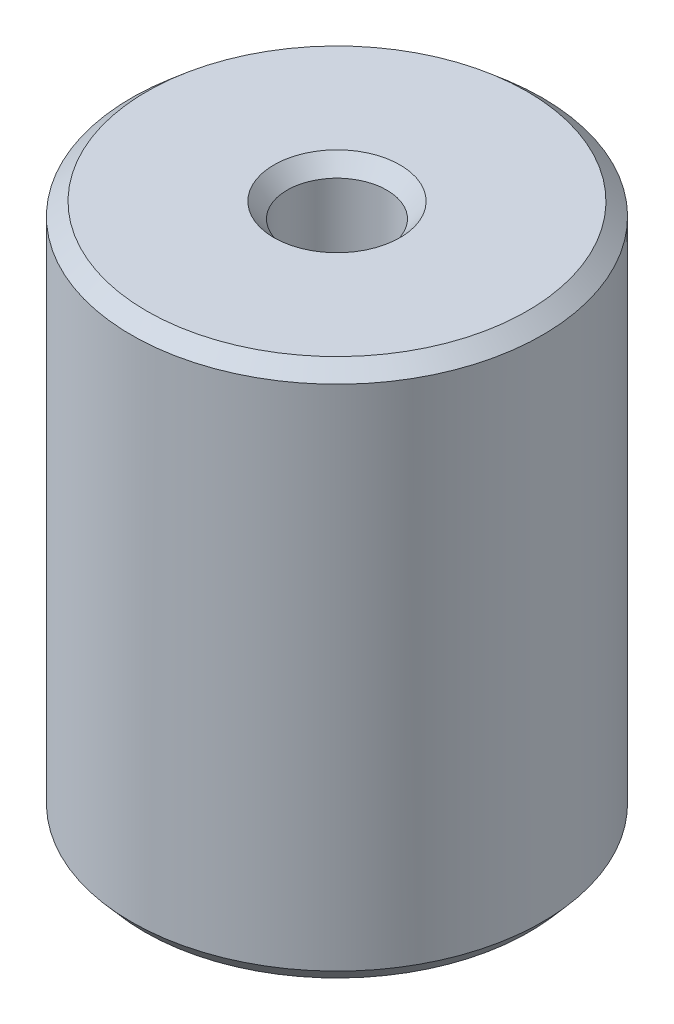
ISO-10303-21;
HEADER;
FILE_DESCRIPTION(('STEP AP214'),'2;1');
FILE_NAME('part.step','',(''),(''),'','','');
FILE_SCHEMA(('AUTOMOTIVE_DESIGN { 1 0 10303 214 1 1 1 1 }'));
ENDSEC;
DATA;
#1=APPLICATION_CONTEXT('core data for automotive mechanical design processes');
#2=APPLICATION_PROTOCOL_DEFINITION('international standard','automotive_design',2000,#1);
#3=PRODUCT_CONTEXT('',#1,'mechanical');
#4=PRODUCT('Part','Part','',(#3));
#5=PRODUCT_RELATED_PRODUCT_CATEGORY('part','',(#4));
#6=PRODUCT_DEFINITION_FORMATION('','',#4);
#7=PRODUCT_DEFINITION_CONTEXT('part definition',#1,'design');
#8=PRODUCT_DEFINITION('design','',#6,#7);
#9=PRODUCT_DEFINITION_SHAPE('','',#8);
#10=(LENGTH_UNIT() NAMED_UNIT(*) SI_UNIT(.MILLI.,.METRE.));
#11=(NAMED_UNIT(*) PLANE_ANGLE_UNIT() SI_UNIT($,.RADIAN.));
#12=(NAMED_UNIT(*) SI_UNIT($,.STERADIAN.) SOLID_ANGLE_UNIT());
#13=UNCERTAINTY_MEASURE_WITH_UNIT(LENGTH_MEASURE(1.E-05),#10,'distance_accuracy_value','');
#14=(GEOMETRIC_REPRESENTATION_CONTEXT(3) GLOBAL_UNCERTAINTY_ASSIGNED_CONTEXT((#13)) GLOBAL_UNIT_ASSIGNED_CONTEXT((#10,
#11,#12)) REPRESENTATION_CONTEXT('',''));
#15=CARTESIAN_POINT('',(0.,0.,0.));
#16=DIRECTION('',(0.,0.,1.));
#17=DIRECTION('',(1.,0.,0.));
#18=AXIS2_PLACEMENT_3D('',#15,#16,#17);
#19=CARTESIAN_POINT('',(0.,13.059607712021,0.));
#20=DIRECTION('',(0.,-1.,0.));
#21=DIRECTION('',(0.,0.,-1.));
#22=AXIS2_PLACEMENT_3D('',#19,#20,#21);
#23=CYLINDRICAL_SURFACE('',#22,5.);
#24=CARTESIAN_POINT('',(0.,0.371428901413239,0.));
#25=DIRECTION('',(0.,1.,0.));
#26=DIRECTION('',(0.,0.,1.));
#27=AXIS2_PLACEMENT_3D('',#24,#25,#26);
#28=CIRCLE('',#27,5.);
#29=CARTESIAN_POINT('',(0.,0.371428901413237,-5.));
#30=VERTEX_POINT('',#29);
#31=EDGE_CURVE('E10',#30,#30,#28,.T.);
#32=CARTESIAN_POINT('',(0.,12.7392117758964,0.));
#33=DIRECTION('',(0.,1.,0.));
#34=DIRECTION('',(0.,0.,1.));
#35=AXIS2_PLACEMENT_3D('',#32,#33,#34);
#36=CIRCLE('',#35,5.);
#37=CARTESIAN_POINT('',(0.,12.7392117758964,-5.));
#38=VERTEX_POINT('',#37);
#39=EDGE_CURVE('E50',#38,#38,#36,.F.);
#40=CARTESIAN_POINT('',(0.,0.371428901413237,-5.));
#41=CARTESIAN_POINT('',(0.,0.500259973022437,-5.));
#42=CARTESIAN_POINT('',(0.,0.629091044631636,-5.));
#43=CARTESIAN_POINT('',(0.,0.886753187850035,-5.));
#44=CARTESIAN_POINT('',(0.,1.01558425945923,-5.));
#45=CARTESIAN_POINT('',(0.,1.27324640267763,-5.));
#46=CARTESIAN_POINT('',(0.,1.40207747428683,-5.));
#47=CARTESIAN_POINT('',(0.,1.65973961750523,-5.));
#48=CARTESIAN_POINT('',(0.,1.78857068911443,-5.));
#49=CARTESIAN_POINT('',(0.,2.04623283233283,-5.));
#50=CARTESIAN_POINT('',(0.,2.17506390394203,-5.));
#51=CARTESIAN_POINT('',(0.,2.43272604716043,-5.));
#52=CARTESIAN_POINT('',(0.,2.56155711876963,-5.));
#53=CARTESIAN_POINT('',(0.,2.81921926198803,-5.));
#54=CARTESIAN_POINT('',(0.,2.94805033359723,-5.));
#55=CARTESIAN_POINT('',(0.,3.20571247681563,-5.));
#56=CARTESIAN_POINT('',(0.,3.33454354842483,-5.));
#57=CARTESIAN_POINT('',(0.,3.59220569164323,-5.));
#58=CARTESIAN_POINT('',(0.,3.72103676325243,-5.));
#59=CARTESIAN_POINT('',(0.,3.97869890647083,-5.));
#60=CARTESIAN_POINT('',(0.,4.10752997808002,-5.));
#61=CARTESIAN_POINT('',(0.,4.36519212129842,-5.));
#62=CARTESIAN_POINT('',(0.,4.49402319290762,-5.));
#63=CARTESIAN_POINT('',(0.,4.75168533612602,-5.));
#64=CARTESIAN_POINT('',(0.,4.88051640773522,-5.));
#65=CARTESIAN_POINT('',(0.,5.13817855095362,-5.));
#66=CARTESIAN_POINT('',(0.,5.26700962256282,-5.));
#67=CARTESIAN_POINT('',(0.,5.52467176578122,-5.));
#68=CARTESIAN_POINT('',(0.,5.65350283739042,-5.));
#69=CARTESIAN_POINT('',(0.,5.91116498060882,-5.));
#70=CARTESIAN_POINT('',(0.,6.03999605221802,-5.));
#71=CARTESIAN_POINT('',(0.,6.29765819543642,-5.));
#72=CARTESIAN_POINT('',(0.,6.42648926704562,-5.));
#73=CARTESIAN_POINT('',(0.,6.68415141026401,-5.));
#74=CARTESIAN_POINT('',(0.,6.81298248187321,-5.));
#75=CARTESIAN_POINT('',(0.,7.07064462509161,-5.));
#76=CARTESIAN_POINT('',(0.,7.19947569670081,-5.));
#77=CARTESIAN_POINT('',(0.,7.45713783991921,-5.));
#78=CARTESIAN_POINT('',(0.,7.58596891152841,-5.));
#79=CARTESIAN_POINT('',(0.,7.84363105474681,-5.));
#80=CARTESIAN_POINT('',(0.,7.97246212635601,-5.));
#81=CARTESIAN_POINT('',(0.,8.23012426957441,-5.));
#82=CARTESIAN_POINT('',(0.,8.35895534118361,-5.));
#83=CARTESIAN_POINT('',(0.,8.61661748440201,-5.));
#84=CARTESIAN_POINT('',(0.,8.74544855601121,-5.));
#85=CARTESIAN_POINT('',(0.,9.00311069922961,-5.));
#86=CARTESIAN_POINT('',(0.,9.13194177083881,-5.));
#87=CARTESIAN_POINT('',(0.,9.3896039140572,-5.));
#88=CARTESIAN_POINT('',(0.,9.5184349856664,-5.));
#89=CARTESIAN_POINT('',(0.,9.7760971288848,-5.));
#90=CARTESIAN_POINT('',(0.,9.904928200494,-5.));
#91=CARTESIAN_POINT('',(0.,10.1625903437124,-5.));
#92=CARTESIAN_POINT('',(0.,10.2914214153216,-5.));
#93=CARTESIAN_POINT('',(0.,10.54908355854,-5.));
#94=CARTESIAN_POINT('',(0.,10.6779146301492,-5.));
#95=CARTESIAN_POINT('',(0.,10.9355767733676,-5.));
#96=CARTESIAN_POINT('',(0.,11.0644078449768,-5.));
#97=CARTESIAN_POINT('',(0.,11.3220699881952,-5.));
#98=CARTESIAN_POINT('',(0.,11.4509010598044,-5.));
#99=CARTESIAN_POINT('',(0.,11.7085632030228,-5.));
#100=CARTESIAN_POINT('',(0.,11.837394274632,-5.));
#101=CARTESIAN_POINT('',(0.,12.0950564178504,-5.));
#102=CARTESIAN_POINT('',(0.,12.2238874894596,-5.));
#103=CARTESIAN_POINT('',(0.,12.481549632678,-5.));
#104=CARTESIAN_POINT('',(0.,12.6103807042872,-5.));
#105=CARTESIAN_POINT('',(0.,12.7392117758964,-5.));
#106=B_SPLINE_CURVE_WITH_KNOTS('',3,(#40,#41,#42,#43,#44,#45,#46,#47,#48,#49,#50,#51,#52,#53,
#54,#55,#56,#57,#58,#59,#60,#61,#62,#63,#64,#65,#66,#67,#68,#69,#70,#71,#72,#73,#74,#75,#76,#77,
#78,#79,#80,#81,#82,#83,#84,#85,#86,#87,#88,#89,#90,#91,#92,#93,#94,#95,#96,#97,#98,#99,#100,
#101,#102,#103,#104,#105),.UNSPECIFIED.,.F.,.F.,(4,2,2,2,2,2,2,2,2,2,2,2,2,2,2,2,2,2,2,2,2,2,2,
2,2,2,2,2,2,2,2,2,4),(0.,0.386493214827598,0.772986429655197,1.1594796444828,1.54597285931039,
1.93246607413799,2.31895928896559,2.70545250379319,3.09194571862079,3.47843893344839,
3.86493214827599,4.25142536310358,4.63791857793118,5.02441179275878,5.41090500758638,
5.79739822241398,6.18389143724158,6.57038465206918,6.95687786689678,7.34337108172437,
7.72986429655197,8.11635751137957,8.50285072620717,8.88934394103477,9.27583715586237,
9.66233037068996,10.0488235855176,10.4353168003452,10.8218100151728,11.2083032300004,
11.594796444828,11.9812896596556,12.3677828744832),.UNSPECIFIED.);
#107=EDGE_CURVE('BSEAM39',#30,#38,#106,.T.);
#108=ORIENTED_EDGE('',*,*,#31,.T.);
#109=ORIENTED_EDGE('',*,*,#39,.T.);
#110=ORIENTED_EDGE('',*,*,#107,.T.);
#111=ORIENTED_EDGE('',*,*,#107,.F.);
#112=EDGE_LOOP('',(#108,#110,#109,#111));
#113=FACE_BOUND('',#112,.T.);
#114=ADVANCED_FACE('F39',(#113),#23,.T.);
#115=CARTESIAN_POINT('',(0.,13.059607712021,0.));
#116=DIRECTION('',(0.,1.,0.));
#117=DIRECTION('',(0.,0.,1.));
#118=AXIS2_PLACEMENT_3D('',#115,#116,#117);
#119=PLANE('',#118);
#120=CARTESIAN_POINT('',(0.,13.059607712021,0.));
#121=DIRECTION('',(0.,1.,0.));
#122=DIRECTION('',(0.,0.,1.));
#123=AXIS2_PLACEMENT_3D('',#120,#121,#122);
#124=CIRCLE('',#123,1.53448347954983);
#125=CARTESIAN_POINT('',(0.,13.059607712021,1.53448347954983));
#126=VERTEX_POINT('',#125);
#127=EDGE_CURVE('E58',#126,#126,#124,.F.);
#128=ORIENTED_EDGE('',*,*,#127,.T.);
#129=EDGE_LOOP('',(#128));
#130=FACE_BOUND('',#129,.T.);
#131=CARTESIAN_POINT('',(0.,13.059607712021,0.));
#132=DIRECTION('',(0.,1.,0.));
#133=DIRECTION('',(0.,0.,1.));
#134=AXIS2_PLACEMENT_3D('',#131,#132,#133);
#135=CIRCLE('',#134,4.62857109858678);
#136=CARTESIAN_POINT('',(0.,13.059607712021,4.62857109858678));
#137=VERTEX_POINT('',#136);
#138=EDGE_CURVE('E61',#137,#137,#135,.T.);
#139=ORIENTED_EDGE('',*,*,#138,.T.);
#140=EDGE_LOOP('',(#139));
#141=FACE_BOUND('',#140,.T.);
#142=ADVANCED_FACE('F88',(#130,#141),#119,.T.);
#143=CARTESIAN_POINT('',(0.,0.,0.));
#144=DIRECTION('',(0.,1.,0.));
#145=DIRECTION('',(0.,0.,1.));
#146=AXIS2_PLACEMENT_3D('',#143,#144,#145);
#147=PLANE('',#146);
#148=CARTESIAN_POINT('',(0.,0.,0.));
#149=DIRECTION('',(0.,1.,0.));
#150=DIRECTION('',(0.,0.,1.));
#151=AXIS2_PLACEMENT_3D('',#148,#149,#150);
#152=CIRCLE('',#151,1.5855164448384);
#153=CARTESIAN_POINT('',(0.,0.,1.5855164448384));
#154=VERTEX_POINT('',#153);
#155=EDGE_CURVE('E51',#154,#154,#152,.T.);
#156=ORIENTED_EDGE('',*,*,#155,.T.);
#157=EDGE_LOOP('',(#156));
#158=FACE_BOUND('',#157,.T.);
#159=CARTESIAN_POINT('',(0.,0.,0.));
#160=DIRECTION('',(0.,1.,0.));
#161=DIRECTION('',(0.,0.,1.));
#162=AXIS2_PLACEMENT_3D('',#159,#160,#161);
#163=CIRCLE('',#162,4.67960406387535);
#164=CARTESIAN_POINT('',(0.,0.,4.67960406387535));
#165=VERTEX_POINT('',#164);
#166=EDGE_CURVE('E54',#165,#165,#163,.F.);
#167=ORIENTED_EDGE('',*,*,#166,.T.);
#168=EDGE_LOOP('',(#167));
#169=FACE_BOUND('',#168,.T.);
#170=ADVANCED_FACE('F83',(#158,#169),#147,.F.);
#171=CARTESIAN_POINT('',(0.,13.059607712021,0.));
#172=DIRECTION('',(0.,-1.,0.));
#173=DIRECTION('',(0.,0.,-1.));
#174=AXIS2_PLACEMENT_3D('',#171,#172,#173);
#175=CYLINDRICAL_SURFACE('',#174,1.21408754342518);
#176=CARTESIAN_POINT('',(0.,12.6881788106078,0.));
#177=DIRECTION('',(0.,1.,0.));
#178=DIRECTION('',(0.,0.,1.));
#179=AXIS2_PLACEMENT_3D('',#176,#177,#178);
#180=CIRCLE('',#179,1.21408754342518);
#181=CARTESIAN_POINT('',(0.,12.6881788106078,-1.21408754342518));
#182=VERTEX_POINT('',#181);
#183=EDGE_CURVE('E67',#182,#182,#180,.T.);
#184=CARTESIAN_POINT('',(0.,0.320395936124641,0.));
#185=DIRECTION('',(0.,1.,0.));
#186=DIRECTION('',(0.,0.,1.));
#187=AXIS2_PLACEMENT_3D('',#184,#185,#186);
#188=CIRCLE('',#187,1.21408754342518);
#189=CARTESIAN_POINT('',(0.,0.320395936124639,-1.21408754342518));
#190=VERTEX_POINT('',#189);
#191=EDGE_CURVE('E69',#190,#190,#188,.F.);
#192=CARTESIAN_POINT('',(0.,12.6881788106078,-1.21408754342518));
#193=CARTESIAN_POINT('',(0.,12.5593477389986,-1.21408754342518));
#194=CARTESIAN_POINT('',(0.,12.4305166673894,-1.21408754342518));
#195=CARTESIAN_POINT('',(0.,12.172854524171,-1.21408754342518));
#196=CARTESIAN_POINT('',(0.,12.0440234525618,-1.21408754342518));
#197=CARTESIAN_POINT('',(0.,11.7863613093434,-1.21408754342518));
#198=CARTESIAN_POINT('',(0.,11.6575302377342,-1.21408754342518));
#199=CARTESIAN_POINT('',(0.,11.3998680945158,-1.21408754342518));
#200=CARTESIAN_POINT('',(0.,11.2710370229066,-1.21408754342518));
#201=CARTESIAN_POINT('',(0.,11.0133748796882,-1.21408754342518));
#202=CARTESIAN_POINT('',(0.,10.884543808079,-1.21408754342518));
#203=CARTESIAN_POINT('',(0.,10.6268816648606,-1.21408754342518));
#204=CARTESIAN_POINT('',(0.,10.4980505932514,-1.21408754342518));
#205=CARTESIAN_POINT('',(0.,10.240388450033,-1.21408754342518));
#206=CARTESIAN_POINT('',(0.,10.1115573784238,-1.21408754342518));
#207=CARTESIAN_POINT('',(0.,9.85389523520541,-1.21408754342518));
#208=CARTESIAN_POINT('',(0.,9.72506416359621,-1.21408754342518));
#209=CARTESIAN_POINT('',(0.,9.46740202037781,-1.21408754342518));
#210=CARTESIAN_POINT('',(0.,9.33857094876861,-1.21408754342518));
#211=CARTESIAN_POINT('',(0.,9.08090880555021,-1.21408754342518));
#212=CARTESIAN_POINT('',(0.,8.95207773394101,-1.21408754342518));
#213=CARTESIAN_POINT('',(0.,8.69441559072262,-1.21408754342518));
#214=CARTESIAN_POINT('',(0.,8.56558451911341,-1.21408754342518));
#215=CARTESIAN_POINT('',(0.,8.30792237589502,-1.21408754342518));
#216=CARTESIAN_POINT('',(0.,8.17909130428582,-1.21408754342518));
#217=CARTESIAN_POINT('',(0.,7.92142916106742,-1.21408754342518));
#218=CARTESIAN_POINT('',(0.,7.79259808945822,-1.21408754342518));
#219=CARTESIAN_POINT('',(0.,7.53493594623982,-1.21408754342518));
#220=CARTESIAN_POINT('',(0.,7.40610487463062,-1.21408754342518));
#221=CARTESIAN_POINT('',(0.,7.14844273141222,-1.21408754342518));
#222=CARTESIAN_POINT('',(0.,7.01961165980302,-1.21408754342518));
#223=CARTESIAN_POINT('',(0.,6.76194951658462,-1.21408754342518));
#224=CARTESIAN_POINT('',(0.,6.63311844497542,-1.21408754342518));
#225=CARTESIAN_POINT('',(0.,6.37545630175702,-1.21408754342518));
#226=CARTESIAN_POINT('',(0.,6.24662523014782,-1.21408754342518));
#227=CARTESIAN_POINT('',(0.,5.98896308692942,-1.21408754342518));
#228=CARTESIAN_POINT('',(0.,5.86013201532022,-1.21408754342518));
#229=CARTESIAN_POINT('',(0.,5.60246987210182,-1.21408754342518));
#230=CARTESIAN_POINT('',(0.,5.47363880049262,-1.21408754342518));
#231=CARTESIAN_POINT('',(0.,5.21597665727422,-1.21408754342518));
#232=CARTESIAN_POINT('',(0.,5.08714558566503,-1.21408754342518));
#233=CARTESIAN_POINT('',(0.,4.82948344244663,-1.21408754342518));
#234=CARTESIAN_POINT('',(0.,4.70065237083743,-1.21408754342518));
#235=CARTESIAN_POINT('',(0.,4.44299022761903,-1.21408754342518));
#236=CARTESIAN_POINT('',(0.,4.31415915600983,-1.21408754342518));
#237=CARTESIAN_POINT('',(0.,4.05649701279143,-1.21408754342518));
#238=CARTESIAN_POINT('',(0.,3.92766594118223,-1.21408754342518));
#239=CARTESIAN_POINT('',(0.,3.67000379796383,-1.21408754342518));
#240=CARTESIAN_POINT('',(0.,3.54117272635463,-1.21408754342518));
#241=CARTESIAN_POINT('',(0.,3.28351058313623,-1.21408754342518));
#242=CARTESIAN_POINT('',(0.,3.15467951152703,-1.21408754342518));
#243=CARTESIAN_POINT('',(0.,2.89701736830863,-1.21408754342518));
#244=CARTESIAN_POINT('',(0.,2.76818629669943,-1.21408754342518));
#245=CARTESIAN_POINT('',(0.,2.51052415348103,-1.21408754342518));
#246=CARTESIAN_POINT('',(0.,2.38169308187183,-1.21408754342518));
#247=CARTESIAN_POINT('',(0.,2.12403093865343,-1.21408754342518));
#248=CARTESIAN_POINT('',(0.,1.99519986704424,-1.21408754342518));
#249=CARTESIAN_POINT('',(0.,1.73753772382584,-1.21408754342518));
#250=CARTESIAN_POINT('',(0.,1.60870665221664,-1.21408754342518));
#251=CARTESIAN_POINT('',(0.,1.35104450899824,-1.21408754342518));
#252=CARTESIAN_POINT('',(0.,1.22221343738904,-1.21408754342518));
#253=CARTESIAN_POINT('',(0.,0.964551294170638,-1.21408754342518));
#254=CARTESIAN_POINT('',(0.,0.835720222561438,-1.21408754342518));
#255=CARTESIAN_POINT('',(0.,0.578058079343038,-1.21408754342518));
#256=CARTESIAN_POINT('',(0.,0.449227007733838,-1.21408754342518));
#257=CARTESIAN_POINT('',(0.,0.320395936124639,-1.21408754342518));
#258=B_SPLINE_CURVE_WITH_KNOTS('',3,(#192,#193,#194,#195,#196,#197,#198,#199,#200,#201,#202,
#203,#204,#205,#206,#207,#208,#209,#210,#211,#212,#213,#214,#215,#216,#217,#218,#219,#220,#221,
#222,#223,#224,#225,#226,#227,#228,#229,#230,#231,#232,#233,#234,#235,#236,#237,#238,#239,#240,
#241,#242,#243,#244,#245,#246,#247,#248,#249,#250,#251,#252,#253,#254,#255,#256,#257),
.UNSPECIFIED.,.F.,.F.,(4,2,2,2,2,2,2,2,2,2,2,2,2,2,2,2,2,2,2,2,2,2,2,2,2,2,2,2,2,2,2,2,4),(0.,
0.3864932148276,0.772986429655198,1.1594796444828,1.5459728593104,1.932466074138,
2.31895928896559,2.70545250379319,3.09194571862079,3.47843893344839,3.86493214827599,
4.25142536310359,4.63791857793119,5.02441179275879,5.41090500758638,5.79739822241398,
6.18389143724158,6.57038465206918,6.95687786689678,7.34337108172438,7.72986429655198,
8.11635751137958,8.50285072620717,8.88934394103477,9.27583715586237,9.66233037068997,
10.0488235855176,10.4353168003452,10.8218100151728,11.2083032300004,11.594796444828,
11.9812896596556,12.3677828744832),.UNSPECIFIED.);
#259=EDGE_CURVE('BSEAM71',#182,#190,#258,.T.);
#260=ORIENTED_EDGE('',*,*,#183,.T.);
#261=ORIENTED_EDGE('',*,*,#191,.T.);
#262=ORIENTED_EDGE('',*,*,#259,.T.);
#263=ORIENTED_EDGE('',*,*,#259,.F.);
#264=EDGE_LOOP('',(#260,#262,#261,#263));
#265=FACE_BOUND('',#264,.T.);
#266=ADVANCED_FACE('F71',(#265),#175,.F.);
#267=CARTESIAN_POINT('',(0.,12.6881788106078,0.));
#268=DIRECTION('',(0.,1.,0.));
#269=DIRECTION('',(0.,0.,1.));
#270=AXIS2_PLACEMENT_3D('',#267,#268,#269);
#271=CONICAL_SURFACE('',#270,1.21408754342518,0.711765792524909);
#272=ORIENTED_EDGE('',*,*,#127,.F.);
#273=EDGE_LOOP('',(#272));
#274=FACE_BOUND('',#273,.T.);
#275=ORIENTED_EDGE('',*,*,#183,.F.);
#276=EDGE_LOOP('',(#275));
#277=FACE_BOUND('',#276,.T.);
#278=ADVANCED_FACE('F77',(#274,#277),#271,.F.);
#279=CARTESIAN_POINT('',(0.,0.,0.));
#280=DIRECTION('',(0.,-1.,0.));
#281=DIRECTION('',(0.,0.,-1.));
#282=AXIS2_PLACEMENT_3D('',#279,#280,#281);
#283=CONICAL_SURFACE('',#282,1.5855164448384,0.859030534269983);
#284=ORIENTED_EDGE('',*,*,#191,.F.);
#285=EDGE_LOOP('',(#284));
#286=FACE_BOUND('',#285,.T.);
#287=ORIENTED_EDGE('',*,*,#155,.F.);
#288=EDGE_LOOP('',(#287));
#289=FACE_BOUND('',#288,.T.);
#290=ADVANCED_FACE('F73',(#286,#289),#283,.F.);
#291=CARTESIAN_POINT('',(0.,0.371428901413239,0.));
#292=DIRECTION('',(0.,1.,0.));
#293=DIRECTION('',(0.,0.,1.));
#294=AXIS2_PLACEMENT_3D('',#291,#292,#293);
#295=CONICAL_SURFACE('',#294,5.,0.711765792524906);
#296=ORIENTED_EDGE('',*,*,#166,.F.);
#297=EDGE_LOOP('',(#296));
#298=FACE_BOUND('',#297,.T.);
#299=ORIENTED_EDGE('',*,*,#31,.F.);
#300=EDGE_LOOP('',(#299));
#301=FACE_BOUND('',#300,.T.);
#302=ADVANCED_FACE('F76',(#298,#301),#295,.T.);
#303=CARTESIAN_POINT('',(0.,13.059607712021,0.));
#304=DIRECTION('',(0.,-1.,0.));
#305=DIRECTION('',(0.,0.,-1.));
#306=AXIS2_PLACEMENT_3D('',#303,#304,#305);
#307=CONICAL_SURFACE('',#306,4.62857109858678,0.859030534269991);
#308=ORIENTED_EDGE('',*,*,#39,.F.);
#309=EDGE_LOOP('',(#308));
#310=FACE_BOUND('',#309,.T.);
#311=ORIENTED_EDGE('',*,*,#138,.F.);
#312=EDGE_LOOP('',(#311));
#313=FACE_BOUND('',#312,.T.);
#314=ADVANCED_FACE('F45',(#310,#313),#307,.T.);
#315=CLOSED_SHELL('',(#114,#142,#170,#266,#278,#290,#302,#314));
#316=MANIFOLD_SOLID_BREP('B2',#315);
#317=ADVANCED_BREP_SHAPE_REPRESENTATION('',(#18,#316),#14);
#318=SHAPE_DEFINITION_REPRESENTATION(#9,#317);
ENDSEC;
END-ISO-10303-21;
